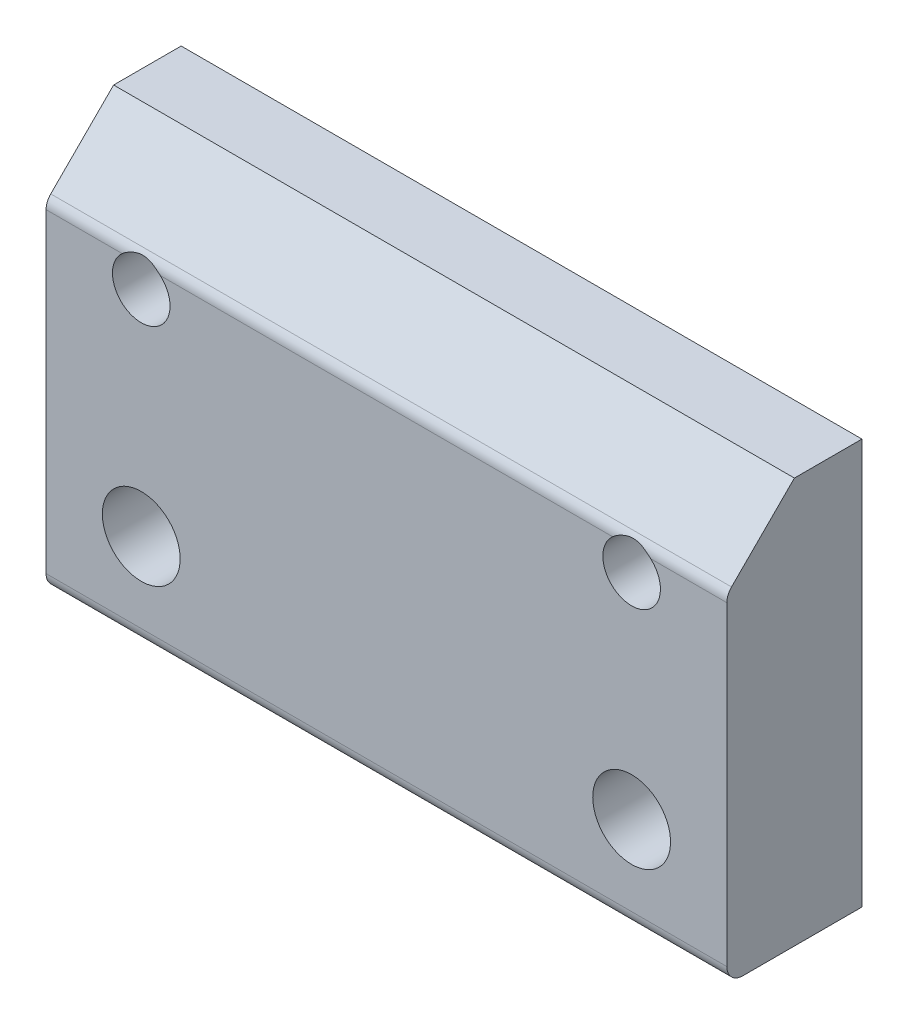
ISO-10303-21;
HEADER;
FILE_DESCRIPTION(('STEP AP214'),'2;1');
FILE_NAME('part.step','',(''),(''),'','','');
FILE_SCHEMA(('AUTOMOTIVE_DESIGN { 1 0 10303 214 1 1 1 1 }'));
ENDSEC;
DATA;
#1=APPLICATION_CONTEXT('core data for automotive mechanical design processes');
#2=APPLICATION_PROTOCOL_DEFINITION('international standard','automotive_design',2000,#1);
#3=PRODUCT_CONTEXT('',#1,'mechanical');
#4=PRODUCT('Part','Part','',(#3));
#5=PRODUCT_RELATED_PRODUCT_CATEGORY('part','',(#4));
#6=PRODUCT_DEFINITION_FORMATION('','',#4);
#7=PRODUCT_DEFINITION_CONTEXT('part definition',#1,'design');
#8=PRODUCT_DEFINITION('design','',#6,#7);
#9=PRODUCT_DEFINITION_SHAPE('','',#8);
#10=(LENGTH_UNIT() NAMED_UNIT(*) SI_UNIT(.MILLI.,.METRE.));
#11=(NAMED_UNIT(*) PLANE_ANGLE_UNIT() SI_UNIT($,.RADIAN.));
#12=(NAMED_UNIT(*) SI_UNIT($,.STERADIAN.) SOLID_ANGLE_UNIT());
#13=UNCERTAINTY_MEASURE_WITH_UNIT(LENGTH_MEASURE(1.E-05),#10,'distance_accuracy_value','');
#14=(GEOMETRIC_REPRESENTATION_CONTEXT(3) GLOBAL_UNCERTAINTY_ASSIGNED_CONTEXT((#13)) GLOBAL_UNIT_ASSIGNED_CONTEXT((#10,
#11,#12)) REPRESENTATION_CONTEXT('',''));
#15=CARTESIAN_POINT('',(0.,0.,0.));
#16=DIRECTION('',(0.,0.,1.));
#17=DIRECTION('',(1.,0.,0.));
#18=AXIS2_PLACEMENT_3D('',#15,#16,#17);
#19=CARTESIAN_POINT('',(16.,9.525,-6.35));
#20=DIRECTION('',(0.,0.,1.));
#21=DIRECTION('',(1.,0.,0.));
#22=AXIS2_PLACEMENT_3D('',#19,#20,#21);
#23=PLANE('',#22);
#24=CARTESIAN_POINT('',(-11.525,-5.025,-6.35));
#25=DIRECTION('',(0.,0.,-1.));
#26=DIRECTION('',(-1.,0.,0.));
#27=AXIS2_PLACEMENT_3D('',#24,#25,#26);
#28=CIRCLE('',#27,1.82879999999997);
#29=CARTESIAN_POINT('',(-13.3538,-5.025,-6.35));
#30=VERTEX_POINT('',#29);
#31=EDGE_CURVE('E208',#30,#30,#28,.T.);
#32=ORIENTED_EDGE('',*,*,#31,.F.);
#33=EDGE_LOOP('',(#32));
#34=FACE_BOUND('',#33,.T.);
#35=CARTESIAN_POINT('',(11.525,-5.025,-6.35));
#36=DIRECTION('',(0.,0.,-1.));
#37=DIRECTION('',(-1.,0.,0.));
#38=AXIS2_PLACEMENT_3D('',#35,#36,#37);
#39=CIRCLE('',#38,1.82879999999997);
#40=CARTESIAN_POINT('',(9.69620000000003,-5.025,-6.35));
#41=VERTEX_POINT('',#40);
#42=EDGE_CURVE('E212',#41,#41,#39,.T.);
#43=ORIENTED_EDGE('',*,*,#42,.F.);
#44=EDGE_LOOP('',(#43));
#45=FACE_BOUND('',#44,.T.);
#46=CARTESIAN_POINT('',(11.525,5.025,-6.35));
#47=DIRECTION('',(0.,0.,-1.));
#48=DIRECTION('',(-1.,0.,0.));
#49=AXIS2_PLACEMENT_3D('',#46,#47,#48);
#50=CIRCLE('',#49,1.35255);
#51=CARTESIAN_POINT('',(10.17245,5.025,-6.35));
#52=VERTEX_POINT('',#51);
#53=EDGE_CURVE('E216',#52,#52,#50,.T.);
#54=ORIENTED_EDGE('',*,*,#53,.F.);
#55=EDGE_LOOP('',(#54));
#56=FACE_BOUND('',#55,.T.);
#57=CARTESIAN_POINT('',(-11.525,5.025,-6.35));
#58=DIRECTION('',(0.,0.,-1.));
#59=DIRECTION('',(-1.,0.,0.));
#60=AXIS2_PLACEMENT_3D('',#57,#58,#59);
#61=CIRCLE('',#60,1.35255);
#62=CARTESIAN_POINT('',(-12.87755,5.025,-6.35));
#63=VERTEX_POINT('',#62);
#64=EDGE_CURVE('E219',#63,#63,#61,.T.);
#65=ORIENTED_EDGE('',*,*,#64,.F.);
#66=EDGE_LOOP('',(#65));
#67=FACE_BOUND('',#66,.T.);
#68=DIRECTION('',(0.,1.,0.));
#69=VECTOR('',#68,1.);
#70=CARTESIAN_POINT('',(-16.,9.525,-6.35));
#71=LINE('',#70,#69);
#72=CARTESIAN_POINT('',(-16.,-9.525,-6.35));
#73=VERTEX_POINT('',#72);
#74=CARTESIAN_POINT('',(-16.,9.525,-6.35));
#75=VERTEX_POINT('',#74);
#76=EDGE_CURVE('E141',#73,#75,#71,.T.);
#77=ORIENTED_EDGE('',*,*,#76,.T.);
#78=DIRECTION('',(-1.,0.,0.));
#79=VECTOR('',#78,1.);
#80=CARTESIAN_POINT('',(16.,9.525,-6.35));
#81=LINE('',#80,#79);
#82=CARTESIAN_POINT('',(16.,9.525,-6.35));
#83=VERTEX_POINT('',#82);
#84=EDGE_CURVE('E125',#83,#75,#81,.T.);
#85=ORIENTED_EDGE('',*,*,#84,.F.);
#86=DIRECTION('',(0.,1.,0.));
#87=VECTOR('',#86,1.);
#88=CARTESIAN_POINT('',(16.,9.525,-6.35));
#89=LINE('',#88,#87);
#90=CARTESIAN_POINT('',(16.,-9.525,-6.35));
#91=VERTEX_POINT('',#90);
#92=EDGE_CURVE('E130',#91,#83,#89,.T.);
#93=ORIENTED_EDGE('',*,*,#92,.F.);
#94=DIRECTION('',(-1.,0.,0.));
#95=VECTOR('',#94,1.);
#96=CARTESIAN_POINT('',(16.,-9.525,-6.35));
#97=LINE('',#96,#95);
#98=EDGE_CURVE('E147',#91,#73,#97,.T.);
#99=ORIENTED_EDGE('',*,*,#98,.T.);
#100=EDGE_LOOP('',(#77,#85,#93,#99));
#101=FACE_BOUND('',#100,.T.);
#102=ADVANCED_FACE('F47',(#34,#45,#56,#67,#101),#23,.F.);
#103=CARTESIAN_POINT('',(16.,9.525,-3.175));
#104=DIRECTION('',(0.,-1.,0.));
#105=DIRECTION('',(0.,0.,-1.));
#106=AXIS2_PLACEMENT_3D('',#103,#104,#105);
#107=PLANE('',#106);
#108=DIRECTION('',(0.,0.,1.));
#109=VECTOR('',#108,1.);
#110=CARTESIAN_POINT('',(-16.,9.525,-3.175));
#111=LINE('',#110,#109);
#112=CARTESIAN_POINT('',(-16.,9.525,-3.175));
#113=VERTEX_POINT('',#112);
#114=EDGE_CURVE('E221',#75,#113,#111,.T.);
#115=ORIENTED_EDGE('',*,*,#114,.T.);
#116=DIRECTION('',(-1.,0.,0.));
#117=VECTOR('',#116,1.);
#118=CARTESIAN_POINT('',(16.,9.525,-3.175));
#119=LINE('',#118,#117);
#120=CARTESIAN_POINT('',(16.,9.525,-3.175));
#121=VERTEX_POINT('',#120);
#122=EDGE_CURVE('E128',#121,#113,#119,.T.);
#123=ORIENTED_EDGE('',*,*,#122,.F.);
#124=DIRECTION('',(0.,0.,1.));
#125=VECTOR('',#124,1.);
#126=CARTESIAN_POINT('',(16.,9.525,-3.175));
#127=LINE('',#126,#125);
#128=EDGE_CURVE('E121',#83,#121,#127,.T.);
#129=ORIENTED_EDGE('',*,*,#128,.F.);
#130=ORIENTED_EDGE('',*,*,#84,.T.);
#131=EDGE_LOOP('',(#115,#123,#129,#130));
#132=FACE_BOUND('',#131,.T.);
#133=ADVANCED_FACE('F123',(#132),#107,.F.);
#134=CARTESIAN_POINT('',(16.,6.34999999999997,0.));
#135=DIRECTION('',(0.,-0.707106781186544,-0.707106781186552));
#136=DIRECTION('',(0.,0.707106781186552,-0.707106781186544));
#137=AXIS2_PLACEMENT_3D('',#134,#135,#136);
#138=PLANE('',#137);
#139=DIRECTION('',(0.,-0.707106781186551,0.707106781186544));
#140=VECTOR('',#139,1.);
#141=CARTESIAN_POINT('',(-16.,6.34999999999997,0.));
#142=LINE('',#141,#140);
#143=CARTESIAN_POINT('',(-16.,6.56966991411005,-0.219669914110087));
#144=VERTEX_POINT('',#143);
#145=EDGE_CURVE('E232',#113,#144,#142,.T.);
#146=ORIENTED_EDGE('',*,*,#145,.T.);
#147=DIRECTION('',(-1.,0.,0.));
#148=VECTOR('',#147,1.);
#149=CARTESIAN_POINT('',(16.,6.56966991411005,-0.219669914110087));
#150=LINE('',#149,#148);
#151=CARTESIAN_POINT('',(16.,6.56966991411005,-0.219669914110087));
#152=VERTEX_POINT('',#151);
#153=EDGE_CURVE('E70',#144,#152,#150,.F.);
#154=ORIENTED_EDGE('',*,*,#153,.T.);
#155=DIRECTION('',(0.,-0.707106781186551,0.707106781186544));
#156=VECTOR('',#155,1.);
#157=CARTESIAN_POINT('',(16.,6.34999999999997,0.));
#158=LINE('',#157,#156);
#159=EDGE_CURVE('E129',#121,#152,#158,.T.);
#160=ORIENTED_EDGE('',*,*,#159,.F.);
#161=ORIENTED_EDGE('',*,*,#122,.T.);
#162=EDGE_LOOP('',(#146,#154,#160,#161));
#163=FACE_BOUND('',#162,.T.);
#164=ADVANCED_FACE('F196',(#163),#138,.F.);
#165=CARTESIAN_POINT('',(16.,6.34999999999997,0.));
#166=DIRECTION('',(0.,0.,-1.));
#167=DIRECTION('',(0.,1.,0.));
#168=AXIS2_PLACEMENT_3D('',#165,#166,#167);
#169=PLANE('',#168);
#170=CARTESIAN_POINT('',(-11.525,-5.025,0.));
#171=DIRECTION('',(0.,0.,-1.));
#172=DIRECTION('',(-1.,0.,0.));
#173=AXIS2_PLACEMENT_3D('',#170,#171,#172);
#174=CIRCLE('',#173,1.82879999999997);
#175=CARTESIAN_POINT('',(-13.3538,-5.025,0.));
#176=VERTEX_POINT('',#175);
#177=EDGE_CURVE('E354',#176,#176,#174,.T.);
#178=ORIENTED_EDGE('',*,*,#177,.T.);
#179=EDGE_LOOP('',(#178));
#180=FACE_BOUND('',#179,.T.);
#181=CARTESIAN_POINT('',(11.525,-5.025,0.));
#182=DIRECTION('',(0.,0.,-1.));
#183=DIRECTION('',(-1.,0.,0.));
#184=AXIS2_PLACEMENT_3D('',#181,#182,#183);
#185=CIRCLE('',#184,1.82879999999997);
#186=CARTESIAN_POINT('',(9.69620000000003,-5.025,0.));
#187=VERTEX_POINT('',#186);
#188=EDGE_CURVE('E223',#187,#187,#185,.T.);
#189=ORIENTED_EDGE('',*,*,#188,.T.);
#190=EDGE_LOOP('',(#189));
#191=FACE_BOUND('',#190,.T.);
#192=CARTESIAN_POINT('',(11.525,5.025,0.));
#193=DIRECTION('',(0.,0.,-1.));
#194=DIRECTION('',(0.,1.,0.));
#195=AXIS2_PLACEMENT_3D('',#192,#193,#194);
#196=CIRCLE('',#195,1.35255);
#197=CARTESIAN_POINT('',(12.4197101292521,6.03933982822015,0.));
#198=VERTEX_POINT('',#197);
#199=CARTESIAN_POINT('',(10.6302898707479,6.03933982822015,0.));
#200=VERTEX_POINT('',#199);
#201=EDGE_CURVE('E145',#198,#200,#196,.T.);
#202=ORIENTED_EDGE('',*,*,#201,.T.);
#203=DIRECTION('',(-1.,0.,0.));
#204=VECTOR('',#203,1.);
#205=CARTESIAN_POINT('',(16.,6.03933982822015,0.));
#206=LINE('',#205,#204);
#207=CARTESIAN_POINT('',(-10.6302898707479,6.03933982822015,0.));
#208=VERTEX_POINT('',#207);
#209=EDGE_CURVE('E159',#200,#208,#206,.T.);
#210=ORIENTED_EDGE('',*,*,#209,.T.);
#211=CARTESIAN_POINT('',(-11.525,5.025,0.));
#212=DIRECTION('',(0.,0.,-1.));
#213=DIRECTION('',(0.,1.,0.));
#214=AXIS2_PLACEMENT_3D('',#211,#212,#213);
#215=CIRCLE('',#214,1.35255);
#216=CARTESIAN_POINT('',(-12.4197101292521,6.03933982822015,0.));
#217=VERTEX_POINT('',#216);
#218=EDGE_CURVE('E142',#208,#217,#215,.T.);
#219=ORIENTED_EDGE('',*,*,#218,.T.);
#220=DIRECTION('',(-1.,0.,0.));
#221=VECTOR('',#220,1.);
#222=CARTESIAN_POINT('',(-14.2098550646261,6.03933982822015,0.));
#223=LINE('',#222,#221);
#224=CARTESIAN_POINT('',(-16.,6.03933982822015,0.));
#225=VERTEX_POINT('',#224);
#226=EDGE_CURVE('E157',#217,#225,#223,.T.);
#227=ORIENTED_EDGE('',*,*,#226,.T.);
#228=DIRECTION('',(0.,-1.,0.));
#229=VECTOR('',#228,1.);
#230=CARTESIAN_POINT('',(-16.,6.34999999999997,0.));
#231=LINE('',#230,#229);
#232=CARTESIAN_POINT('',(-16.,-8.775,0.));
#233=VERTEX_POINT('',#232);
#234=EDGE_CURVE('E234',#225,#233,#231,.T.);
#235=ORIENTED_EDGE('',*,*,#234,.T.);
#236=DIRECTION('',(-1.,0.,0.));
#237=VECTOR('',#236,1.);
#238=CARTESIAN_POINT('',(16.,-8.775,0.));
#239=LINE('',#238,#237);
#240=CARTESIAN_POINT('',(16.,-8.775,0.));
#241=VERTEX_POINT('',#240);
#242=EDGE_CURVE('E153',#233,#241,#239,.F.);
#243=ORIENTED_EDGE('',*,*,#242,.T.);
#244=DIRECTION('',(0.,-1.,0.));
#245=VECTOR('',#244,1.);
#246=CARTESIAN_POINT('',(16.,6.34999999999997,0.));
#247=LINE('',#246,#245);
#248=CARTESIAN_POINT('',(16.,6.03933982822015,0.));
#249=VERTEX_POINT('',#248);
#250=EDGE_CURVE('E228',#249,#241,#247,.T.);
#251=ORIENTED_EDGE('',*,*,#250,.F.);
#252=DIRECTION('',(-1.,0.,0.));
#253=VECTOR('',#252,1.);
#254=CARTESIAN_POINT('',(14.2098550646261,6.03933982822015,0.));
#255=LINE('',#254,#253);
#256=EDGE_CURVE('E155',#249,#198,#255,.T.);
#257=ORIENTED_EDGE('',*,*,#256,.T.);
#258=EDGE_LOOP('',(#202,#210,#219,#227,#235,#243,#251,#257));
#259=FACE_BOUND('',#258,.T.);
#260=ADVANCED_FACE('F192',(#180,#191,#259),#169,.F.);
#261=CARTESIAN_POINT('',(16.,-9.525,0.));
#262=DIRECTION('',(0.,1.,0.));
#263=DIRECTION('',(0.,0.,1.));
#264=AXIS2_PLACEMENT_3D('',#261,#262,#263);
#265=PLANE('',#264);
#266=DIRECTION('',(0.,0.,-1.));
#267=VECTOR('',#266,1.);
#268=CARTESIAN_POINT('',(16.,-9.525,0.));
#269=LINE('',#268,#267);
#270=CARTESIAN_POINT('',(16.,-9.525,-0.750000000000002));
#271=VERTEX_POINT('',#270);
#272=EDGE_CURVE('E134',#271,#91,#269,.T.);
#273=ORIENTED_EDGE('',*,*,#272,.F.);
#274=DIRECTION('',(-1.,0.,0.));
#275=VECTOR('',#274,1.);
#276=CARTESIAN_POINT('',(16.,-9.525,-0.750000000000002));
#277=LINE('',#276,#275);
#278=CARTESIAN_POINT('',(-16.,-9.525,-0.750000000000002));
#279=VERTEX_POINT('',#278);
#280=EDGE_CURVE('E13',#271,#279,#277,.T.);
#281=ORIENTED_EDGE('',*,*,#280,.T.);
#282=DIRECTION('',(0.,0.,-1.));
#283=VECTOR('',#282,1.);
#284=CARTESIAN_POINT('',(-16.,-9.525,0.));
#285=LINE('',#284,#283);
#286=EDGE_CURVE('E138',#279,#73,#285,.T.);
#287=ORIENTED_EDGE('',*,*,#286,.T.);
#288=ORIENTED_EDGE('',*,*,#98,.F.);
#289=EDGE_LOOP('',(#273,#281,#287,#288));
#290=FACE_BOUND('',#289,.T.);
#291=ADVANCED_FACE('F186',(#290),#265,.F.);
#292=CARTESIAN_POINT('',(16.,0.,0.));
#293=DIRECTION('',(1.,0.,0.));
#294=DIRECTION('',(0.,0.,-1.));
#295=AXIS2_PLACEMENT_3D('',#292,#293,#294);
#296=PLANE('',#295);
#297=ORIENTED_EDGE('',*,*,#159,.T.);
#298=CARTESIAN_POINT('',(16.,6.03933982822015,-0.75));
#299=DIRECTION('',(1.,0.,0.));
#300=DIRECTION('',(0.,0.,-1.));
#301=AXIS2_PLACEMENT_3D('',#298,#299,#300);
#302=CIRCLE('',#301,0.75);
#303=EDGE_CURVE('E241',#152,#249,#302,.T.);
#304=ORIENTED_EDGE('',*,*,#303,.T.);
#305=ORIENTED_EDGE('',*,*,#250,.T.);
#306=CARTESIAN_POINT('',(16.,-8.775,-0.750000000000002));
#307=DIRECTION('',(1.,0.,0.));
#308=DIRECTION('',(0.,0.,-1.));
#309=AXIS2_PLACEMENT_3D('',#306,#307,#308);
#310=CIRCLE('',#309,0.75);
#311=EDGE_CURVE('E62',#241,#271,#310,.T.);
#312=ORIENTED_EDGE('',*,*,#311,.T.);
#313=ORIENTED_EDGE('',*,*,#272,.T.);
#314=ORIENTED_EDGE('',*,*,#92,.T.);
#315=ORIENTED_EDGE('',*,*,#128,.T.);
#316=EDGE_LOOP('',(#297,#304,#305,#312,#313,#314,#315));
#317=FACE_BOUND('',#316,.T.);
#318=ADVANCED_FACE('F133',(#317),#296,.T.);
#319=CARTESIAN_POINT('',(-16.,0.,0.));
#320=DIRECTION('',(1.,0.,0.));
#321=DIRECTION('',(0.,0.,-1.));
#322=AXIS2_PLACEMENT_3D('',#319,#320,#321);
#323=PLANE('',#322);
#324=ORIENTED_EDGE('',*,*,#234,.F.);
#325=CARTESIAN_POINT('',(-16.,6.03933982822015,-0.75));
#326=DIRECTION('',(1.,0.,0.));
#327=DIRECTION('',(0.,0.,-1.));
#328=AXIS2_PLACEMENT_3D('',#325,#326,#327);
#329=CIRCLE('',#328,0.75);
#330=EDGE_CURVE('E254',#225,#144,#329,.F.);
#331=ORIENTED_EDGE('',*,*,#330,.T.);
#332=ORIENTED_EDGE('',*,*,#145,.F.);
#333=ORIENTED_EDGE('',*,*,#114,.F.);
#334=ORIENTED_EDGE('',*,*,#76,.F.);
#335=ORIENTED_EDGE('',*,*,#286,.F.);
#336=CARTESIAN_POINT('',(-16.,-8.775,-0.750000000000002));
#337=DIRECTION('',(1.,0.,0.));
#338=DIRECTION('',(0.,0.,-1.));
#339=AXIS2_PLACEMENT_3D('',#336,#337,#338);
#340=CIRCLE('',#339,0.75);
#341=EDGE_CURVE('E169',#279,#233,#340,.F.);
#342=ORIENTED_EDGE('',*,*,#341,.T.);
#343=EDGE_LOOP('',(#324,#331,#332,#333,#334,#335,#342));
#344=FACE_BOUND('',#343,.T.);
#345=ADVANCED_FACE('F180',(#344),#323,.F.);
#346=CARTESIAN_POINT('',(-11.525,5.025,-6.35));
#347=DIRECTION('',(0.,0.,-1.));
#348=DIRECTION('',(-1.,0.,0.));
#349=AXIS2_PLACEMENT_3D('',#346,#347,#348);
#350=CYLINDRICAL_SURFACE('',#349,1.35255);
#351=ORIENTED_EDGE('',*,*,#64,.T.);
#352=EDGE_LOOP('',(#351));
#353=FACE_BOUND('',#352,.T.);
#354=ORIENTED_EDGE('',*,*,#218,.F.);
#355=CARTESIAN_POINT('',(-10.6302898707479,6.03933982822015,0.));
#356=CARTESIAN_POINT('',(-10.6541537056567,6.06039156132562,-3.79900557443393E-06));
#357=CARTESIAN_POINT('',(-10.6787404479971,6.08057852292136,-0.00088557611417199));
#358=CARTESIAN_POINT('',(-10.7291925365121,6.11911492735218,-0.00400383935589434));
#359=CARTESIAN_POINT('',(-10.75505641776,6.13746640563877,-0.00623880502486901));
#360=CARTESIAN_POINT('',(-10.8343748845607,6.18965986253408,-0.014374391470955));
#361=CARTESIAN_POINT('',(-10.8895758939129,6.22065809186072,-0.0217063539007951));
#362=CARTESIAN_POINT('',(-11.0089425955445,6.27713533590165,-0.0380330227697951));
#363=CARTESIAN_POINT('',(-11.0734639894052,6.30182801772388,-0.04711907964616));
#364=CARTESIAN_POINT('',(-11.2057970877973,6.34114856250529,-0.0630719510288863));
#365=CARTESIAN_POINT('',(-11.2736066075748,6.35578301303189,-0.0699402164960303));
#366=CARTESIAN_POINT('',(-11.3796070766201,6.37024304125517,-0.0769250071011146));
#367=CARTESIAN_POINT('',(-11.4172149858844,6.37377793773495,-0.078691999753124));
#368=CARTESIAN_POINT('',(-11.4926458733401,6.37768963214574,-0.0806527778711968));
#369=CARTESIAN_POINT('',(-11.5304688580407,6.37806633397899,-0.0808465154661453));
#370=CARTESIAN_POINT('',(-11.6060038837106,6.37565119481226,-0.0796297368150378));
#371=CARTESIAN_POINT('',(-11.6437158649557,6.37285788128981,-0.078218475020628));
#372=CARTESIAN_POINT('',(-11.7186998479527,6.36414089682362,-0.0739625698759837));
#373=CARTESIAN_POINT('',(-11.7559716660109,6.35821596308877,-0.071117348318904));
#374=CARTESIAN_POINT('',(-11.8601396591811,6.33716440577297,-0.061501352491214));
#375=CARTESIAN_POINT('',(-11.9262219995787,6.31847705589952,-0.0534257958702267));
#376=CARTESIAN_POINT('',(-12.0546130772475,6.27142689063229,-0.036379274892207));
#377=CARTESIAN_POINT('',(-12.1169254038242,6.24307345427973,-0.0274091844516081));
#378=CARTESIAN_POINT('',(-12.2201340555991,6.18629829948982,-0.0141317810912578));
#379=CARTESIAN_POINT('',(-12.2621686260268,6.16008642029229,-0.00922145208724686));
#380=CARTESIAN_POINT('',(-12.3432880485249,6.10308337837738,-0.00216732392117173));
#381=CARTESIAN_POINT('',(-12.3823706724265,6.07228880764258,-2.55952694219856E-05));
#382=CARTESIAN_POINT('',(-12.4197101292521,6.03933982822015,0.));
#383=B_SPLINE_CURVE_WITH_KNOTS('',3,(#355,#356,#357,#358,#359,#360,#361,#362,#363,#364,#365,
#366,#367,#368,#369,#370,#371,#372,#373,#374,#375,#376,#377,#378,#379,#380,#381,#382),
.UNSPECIFIED.,.F.,.F.,(4,2,2,2,2,2,2,2,2,2,2,2,2,4),(0.,0.0953871282273541,0.190667276351371,
0.381150131945864,0.589431215503298,0.797575756514316,0.910877051988525,1.02418179498956,
1.1375391913937,1.25094233282264,1.45749503704072,1.66384789011924,1.81283999594309,
1.961943461849),.UNSPECIFIED.);
#384=EDGE_CURVE('E162',#208,#217,#383,.T.);
#385=ORIENTED_EDGE('',*,*,#384,.T.);
#386=EDGE_LOOP('',(#354,#385));
#387=FACE_BOUND('',#386,.T.);
#388=ADVANCED_FACE('F174',(#353,#387),#350,.F.);
#389=CARTESIAN_POINT('',(11.525,5.025,-6.35));
#390=DIRECTION('',(0.,0.,-1.));
#391=DIRECTION('',(-1.,0.,0.));
#392=AXIS2_PLACEMENT_3D('',#389,#390,#391);
#393=CYLINDRICAL_SURFACE('',#392,1.35255);
#394=ORIENTED_EDGE('',*,*,#53,.T.);
#395=EDGE_LOOP('',(#394));
#396=FACE_BOUND('',#395,.T.);
#397=ORIENTED_EDGE('',*,*,#201,.F.);
#398=CARTESIAN_POINT('',(12.4197101292521,6.03933982822015,0.));
#399=CARTESIAN_POINT('',(12.3958462943433,6.06039156132562,-3.79900557431148E-06));
#400=CARTESIAN_POINT('',(12.3712595520029,6.08057852292136,-0.000885576114171913));
#401=CARTESIAN_POINT('',(12.3208074634879,6.11911492735218,-0.00400383935589434));
#402=CARTESIAN_POINT('',(12.29494358224,6.13746640563877,-0.00623880502486904));
#403=CARTESIAN_POINT('',(12.2156251154393,6.18965986253408,-0.0143743914709551));
#404=CARTESIAN_POINT('',(12.1604241060871,6.22065809186072,-0.0217063539007952));
#405=CARTESIAN_POINT('',(12.0410574044555,6.27713533590166,-0.0380330227697953));
#406=CARTESIAN_POINT('',(11.9765360105948,6.30182801772388,-0.0471190796461602));
#407=CARTESIAN_POINT('',(11.8442029122027,6.34114856250529,-0.0630719510288864));
#408=CARTESIAN_POINT('',(11.7763933924252,6.35578301303189,-0.0699402164960304));
#409=CARTESIAN_POINT('',(11.6703929233799,6.37024304125517,-0.0769250071011147));
#410=CARTESIAN_POINT('',(11.6327850141156,6.37377793773495,-0.0786919997531241));
#411=CARTESIAN_POINT('',(11.5573541266599,6.37768963214574,-0.0806527778711968));
#412=CARTESIAN_POINT('',(11.5195311419593,6.37806633397899,-0.0808465154661453));
#413=CARTESIAN_POINT('',(11.4439961162894,6.37565119481226,-0.0796297368150377));
#414=CARTESIAN_POINT('',(11.4062841350443,6.37285788128981,-0.0782184750206279));
#415=CARTESIAN_POINT('',(11.3313001520473,6.36414089682362,-0.0739625698759836));
#416=CARTESIAN_POINT('',(11.2940283339891,6.35821596308877,-0.0711173483189039));
#417=CARTESIAN_POINT('',(11.1898603408189,6.33716440577297,-0.0615013524912139));
#418=CARTESIAN_POINT('',(11.1237780004213,6.31847705589952,-0.0534257958702267));
#419=CARTESIAN_POINT('',(10.9953869227525,6.27142689063229,-0.036379274892207));
#420=CARTESIAN_POINT('',(10.9330745961758,6.24307345427973,-0.0274091844516081));
#421=CARTESIAN_POINT('',(10.8298659444009,6.18629829948982,-0.0141317810912579));
#422=CARTESIAN_POINT('',(10.7878313739732,6.16008642029229,-0.00922145208724702));
#423=CARTESIAN_POINT('',(10.7067119514751,6.10308337837738,-0.00216732392117181));
#424=CARTESIAN_POINT('',(10.6676293275735,6.07228880764258,-2.55952694220093E-05));
#425=CARTESIAN_POINT('',(10.6302898707479,6.03933982822015,0.));
#426=B_SPLINE_CURVE_WITH_KNOTS('',3,(#398,#399,#400,#401,#402,#403,#404,#405,#406,#407,#408,
#409,#410,#411,#412,#413,#414,#415,#416,#417,#418,#419,#420,#421,#422,#423,#424,#425),
.UNSPECIFIED.,.F.,.F.,(4,2,2,2,2,2,2,2,2,2,2,2,2,4),(0.,0.0953871282273541,0.190667276351371,
0.381150131945864,0.589431215503302,0.797575756514316,0.910877051988525,1.02418179498956,
1.1375391913937,1.25094233282264,1.45749503704072,1.66384789011924,1.81283999594309,
1.961943461849),.UNSPECIFIED.);
#427=EDGE_CURVE('E55',#198,#200,#426,.T.);
#428=ORIENTED_EDGE('',*,*,#427,.T.);
#429=EDGE_LOOP('',(#397,#428));
#430=FACE_BOUND('',#429,.T.);
#431=ADVANCED_FACE('F179',(#396,#430),#393,.F.);
#432=CARTESIAN_POINT('',(16.,6.03933982822015,-0.75));
#433=DIRECTION('',(-1.,0.,0.));
#434=DIRECTION('',(0.,0.,1.));
#435=AXIS2_PLACEMENT_3D('',#432,#433,#434);
#436=CYLINDRICAL_SURFACE('',#435,0.75);
#437=ORIENTED_EDGE('',*,*,#303,.F.);
#438=ORIENTED_EDGE('',*,*,#153,.F.);
#439=ORIENTED_EDGE('',*,*,#330,.F.);
#440=ORIENTED_EDGE('',*,*,#226,.F.);
#441=ORIENTED_EDGE('',*,*,#384,.F.);
#442=ORIENTED_EDGE('',*,*,#209,.F.);
#443=ORIENTED_EDGE('',*,*,#427,.F.);
#444=ORIENTED_EDGE('',*,*,#256,.F.);
#445=EDGE_LOOP('',(#437,#438,#439,#440,#441,#442,#443,#444));
#446=FACE_BOUND('',#445,.T.);
#447=ADVANCED_FACE('F171',(#446),#436,.T.);
#448=CARTESIAN_POINT('',(16.,-8.775,-0.750000000000002));
#449=DIRECTION('',(-1.,0.,0.));
#450=DIRECTION('',(0.,0.,1.));
#451=AXIS2_PLACEMENT_3D('',#448,#449,#450);
#452=CYLINDRICAL_SURFACE('',#451,0.75);
#453=ORIENTED_EDGE('',*,*,#311,.F.);
#454=ORIENTED_EDGE('',*,*,#242,.F.);
#455=ORIENTED_EDGE('',*,*,#341,.F.);
#456=ORIENTED_EDGE('',*,*,#280,.F.);
#457=EDGE_LOOP('',(#453,#454,#455,#456));
#458=FACE_BOUND('',#457,.T.);
#459=ADVANCED_FACE('F49',(#458),#452,.T.);
#460=CARTESIAN_POINT('',(11.525,-5.025,-6.35));
#461=DIRECTION('',(0.,0.,-1.));
#462=DIRECTION('',(-1.,0.,0.));
#463=AXIS2_PLACEMENT_3D('',#460,#461,#462);
#464=CYLINDRICAL_SURFACE('',#463,1.82879999999997);
#465=ORIENTED_EDGE('',*,*,#188,.F.);
#466=EDGE_LOOP('',(#465));
#467=FACE_BOUND('',#466,.T.);
#468=ORIENTED_EDGE('',*,*,#42,.T.);
#469=EDGE_LOOP('',(#468));
#470=FACE_BOUND('',#469,.T.);
#471=ADVANCED_FACE('F261',(#467,#470),#464,.F.);
#472=CARTESIAN_POINT('',(-11.525,-5.025,-6.35));
#473=DIRECTION('',(0.,0.,-1.));
#474=DIRECTION('',(-1.,0.,0.));
#475=AXIS2_PLACEMENT_3D('',#472,#473,#474);
#476=CYLINDRICAL_SURFACE('',#475,1.82879999999997);
#477=ORIENTED_EDGE('',*,*,#177,.F.);
#478=EDGE_LOOP('',(#477));
#479=FACE_BOUND('',#478,.T.);
#480=ORIENTED_EDGE('',*,*,#31,.T.);
#481=EDGE_LOOP('',(#480));
#482=FACE_BOUND('',#481,.T.);
#483=ADVANCED_FACE('F266',(#479,#482),#476,.F.);
#484=CLOSED_SHELL('',(#102,#133,#164,#260,#291,#318,#345,#388,#431,#447,#459,#471,#483));
#485=MANIFOLD_SOLID_BREP('B2',#484);
#486=ADVANCED_BREP_SHAPE_REPRESENTATION('',(#18,#485),#14);
#487=SHAPE_DEFINITION_REPRESENTATION(#9,#486);
ENDSEC;
END-ISO-10303-21;
